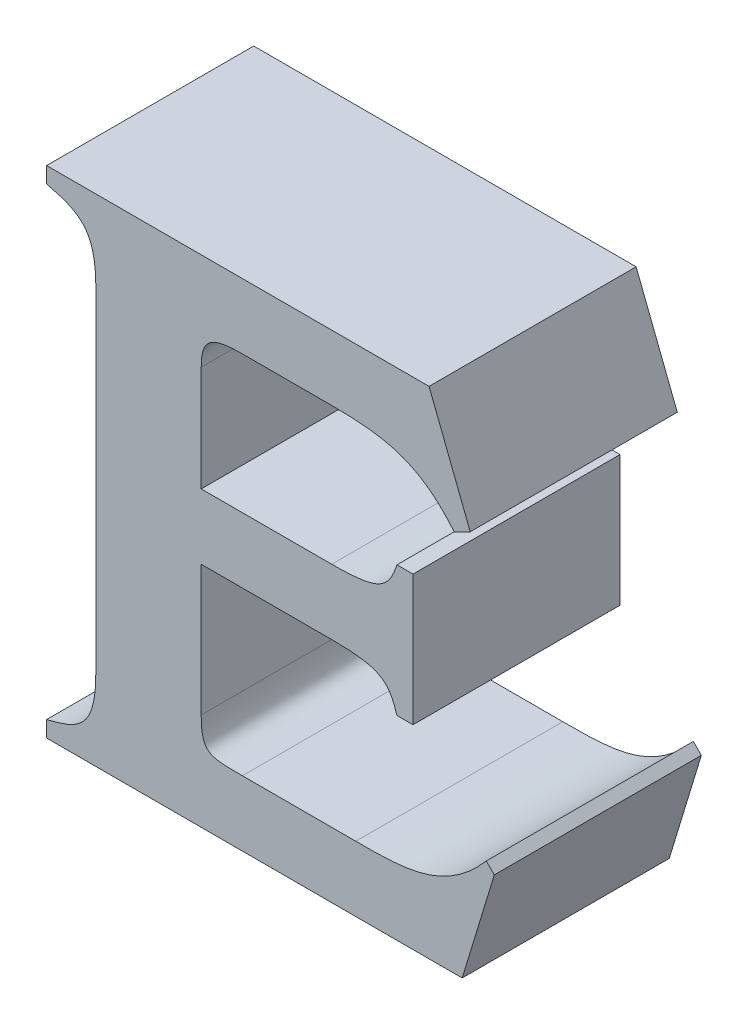
ISO-10303-21;
HEADER;
FILE_DESCRIPTION(('STEP AP214'),'2;1');
FILE_NAME('part.step','',(''),(''),'','','');
FILE_SCHEMA(('AUTOMOTIVE_DESIGN { 1 0 10303 214 1 1 1 1 }'));
ENDSEC;
DATA;
#1=APPLICATION_CONTEXT('core data for automotive mechanical design processes');
#2=APPLICATION_PROTOCOL_DEFINITION('international standard','automotive_design',2000,#1);
#3=PRODUCT_CONTEXT('',#1,'mechanical');
#4=PRODUCT('Part','Part','',(#3));
#5=PRODUCT_RELATED_PRODUCT_CATEGORY('part','',(#4));
#6=PRODUCT_DEFINITION_FORMATION('','',#4);
#7=PRODUCT_DEFINITION_CONTEXT('part definition',#1,'design');
#8=PRODUCT_DEFINITION('design','',#6,#7);
#9=PRODUCT_DEFINITION_SHAPE('','',#8);
#10=(LENGTH_UNIT() NAMED_UNIT(*) SI_UNIT(.MILLI.,.METRE.));
#11=(NAMED_UNIT(*) PLANE_ANGLE_UNIT() SI_UNIT($,.RADIAN.));
#12=(NAMED_UNIT(*) SI_UNIT($,.STERADIAN.) SOLID_ANGLE_UNIT());
#13=UNCERTAINTY_MEASURE_WITH_UNIT(LENGTH_MEASURE(1.E-05),#10,'distance_accuracy_value','');
#14=(GEOMETRIC_REPRESENTATION_CONTEXT(3) GLOBAL_UNCERTAINTY_ASSIGNED_CONTEXT((#13)) GLOBAL_UNIT_ASSIGNED_CONTEXT((#10,
#11,#12)) REPRESENTATION_CONTEXT('',''));
#15=CARTESIAN_POINT('',(0.,0.,0.));
#16=DIRECTION('',(0.,0.,1.));
#17=DIRECTION('',(1.,0.,0.));
#18=AXIS2_PLACEMENT_3D('',#15,#16,#17);
#19=CARTESIAN_POINT('',(2.3235541051335,-0.0690738994527997,0.));
#20=DIRECTION('',(0.,-1.,0.));
#21=DIRECTION('',(1.,0.,0.));
#22=AXIS2_PLACEMENT_3D('',#19,#20,#21);
#23=PLANE('',#22);
#24=DIRECTION('',(-1.,0.,0.));
#25=VECTOR('',#24,1.);
#26=CARTESIAN_POINT('',(2.5242503786031,-0.0690738994527997,0.));
#27=LINE('',#26,#25);
#28=CARTESIAN_POINT('',(2.5242503786031,-0.0690738994527997,0.));
#29=VERTEX_POINT('',#28);
#30=CARTESIAN_POINT('',(2.3235541051335,-0.0690738994527997,0.));
#31=VERTEX_POINT('',#30);
#32=EDGE_CURVE('E11',#29,#31,#27,.T.);
#33=ORIENTED_EDGE('',*,*,#32,.F.);
#34=DIRECTION('',(0.,0.,1.));
#35=VECTOR('',#34,1.);
#36=CARTESIAN_POINT('',(2.5242503786031,-0.0690738994527997,0.));
#37=LINE('',#36,#35);
#38=CARTESIAN_POINT('',(2.5242503786031,-0.0690738994527997,0.1));
#39=VERTEX_POINT('',#38);
#40=EDGE_CURVE('E24',#29,#39,#37,.T.);
#41=ORIENTED_EDGE('',*,*,#40,.T.);
#42=DIRECTION('',(1.,0.,0.));
#43=VECTOR('',#42,1.);
#44=CARTESIAN_POINT('',(2.5242503786031,-0.0690738994527997,0.1));
#45=LINE('',#44,#43);
#46=CARTESIAN_POINT('',(2.3235541051335,-0.0690738994527997,0.1));
#47=VERTEX_POINT('',#46);
#48=EDGE_CURVE('E208',#47,#39,#45,.T.);
#49=ORIENTED_EDGE('',*,*,#48,.F.);
#50=DIRECTION('',(0.,0.,1.));
#51=VECTOR('',#50,1.);
#52=CARTESIAN_POINT('',(2.3235541051335,-0.0690738994527997,0.));
#53=LINE('',#52,#51);
#54=EDGE_CURVE('E473',#31,#47,#53,.T.);
#55=ORIENTED_EDGE('',*,*,#54,.F.);
#56=EDGE_LOOP('',(#33,#41,#49,#55));
#57=FACE_BOUND('',#56,.T.);
#58=ADVANCED_FACE('F17',(#57),#23,.T.);
#59=CARTESIAN_POINT('',(2.3235541051335,-0.0613175045024918,0.));
#60=DIRECTION('',(-1.,0.,0.));
#61=DIRECTION('',(0.,-1.,0.));
#62=AXIS2_PLACEMENT_3D('',#59,#60,#61);
#63=PLANE('',#62);
#64=DIRECTION('',(0.,1.,0.));
#65=VECTOR('',#64,1.);
#66=CARTESIAN_POINT('',(2.3235541051335,-0.0690738994527997,0.));
#67=LINE('',#66,#65);
#68=CARTESIAN_POINT('',(2.3235541051335,-0.0613175045024918,0.));
#69=VERTEX_POINT('',#68);
#70=EDGE_CURVE('E471',#31,#69,#67,.T.);
#71=ORIENTED_EDGE('',*,*,#70,.F.);
#72=ORIENTED_EDGE('',*,*,#54,.T.);
#73=DIRECTION('',(0.,-1.,0.));
#74=VECTOR('',#73,1.);
#75=CARTESIAN_POINT('',(2.3235541051335,-0.0690738994527997,0.1));
#76=LINE('',#75,#74);
#77=CARTESIAN_POINT('',(2.3235541051335,-0.0613175045024918,0.1));
#78=VERTEX_POINT('',#77);
#79=EDGE_CURVE('E469',#78,#47,#76,.T.);
#80=ORIENTED_EDGE('',*,*,#79,.F.);
#81=DIRECTION('',(0.,0.,1.));
#82=VECTOR('',#81,1.);
#83=CARTESIAN_POINT('',(2.3235541051335,-0.0613175045024918,0.));
#84=LINE('',#83,#82);
#85=EDGE_CURVE('E463',#69,#78,#84,.T.);
#86=ORIENTED_EDGE('',*,*,#85,.F.);
#87=EDGE_LOOP('',(#71,#72,#80,#86));
#88=FACE_BOUND('',#87,.T.);
#89=ADVANCED_FACE('F567',(#88),#63,.T.);
#90=CARTESIAN_POINT('',(2.3473078552455,-0.0298073234104864,0.));
#91=CARTESIAN_POINT('',(2.3473078552455,-0.0298073234104864,0.1));
#92=CARTESIAN_POINT('',(2.3473078554093,-0.0535611100527961,0.));
#93=CARTESIAN_POINT('',(2.3473078554093,-0.0535611100527961,0.1));
#94=CARTESIAN_POINT('',(2.3395517125859,-0.0574392172899411,0.));
#95=CARTESIAN_POINT('',(2.3395517125859,-0.0574392172899411,0.1));
#96=CARTESIAN_POINT('',(2.3235541051335,-0.0613175045024918,0.));
#97=CARTESIAN_POINT('',(2.3235541051335,-0.0613175045024918,0.1));
#98=B_SPLINE_SURFACE_WITH_KNOTS('',3,1,((#90,#91),(#92,#93),(#94,#95),(#96,#97)),.UNSPECIFIED.,
.F.,.F.,.F.,(4,4),(2,2),(-1.,0.),(0.,0.01),.UNSPECIFIED.);
#99=CARTESIAN_POINT('',(2.3235541051335,-0.0613175045024918,0.));
#100=CARTESIAN_POINT('',(2.3395517125859,-0.0574392172899411,0.));
#101=CARTESIAN_POINT('',(2.3473078554093,-0.0535611100527961,0.));
#102=CARTESIAN_POINT('',(2.3473078552455,-0.0298073234104864,0.));
#103=B_SPLINE_CURVE_WITH_KNOTS('',3,(#99,#100,#101,#102),.UNSPECIFIED.,.F.,.F.,(4,4),(0.,1.),.UNSPECIFIED.);
#104=CARTESIAN_POINT('',(2.3473078552455,-0.0298073234104864,0.));
#105=VERTEX_POINT('',#104);
#106=EDGE_CURVE('E456',#69,#105,#103,.T.);
#107=CARTESIAN_POINT('',(2.3473078552455,-0.0298073234104864,0.1));
#108=CARTESIAN_POINT('',(2.3473078554093,-0.0535611100527961,0.1));
#109=CARTESIAN_POINT('',(2.3395517125859,-0.0574392172899411,0.1));
#110=CARTESIAN_POINT('',(2.3235541051335,-0.0613175045024918,0.1));
#111=B_SPLINE_CURVE_WITH_KNOTS('',3,(#107,#108,#109,#110),.UNSPECIFIED.,.F.,.F.,(4,4),(-1.,0.),.UNSPECIFIED.);
#112=CARTESIAN_POINT('',(2.3473078552455,-0.0298073234104864,0.1));
#113=VERTEX_POINT('',#112);
#114=EDGE_CURVE('E451',#113,#78,#111,.T.);
#115=DIRECTION('',(0.,0.,1.));
#116=VECTOR('',#115,1.);
#117=CARTESIAN_POINT('',(2.3473078552455,-0.0298073234104864,0.));
#118=LINE('',#117,#116);
#119=EDGE_CURVE('E448',#105,#113,#118,.T.);
#120=ORIENTED_EDGE('',*,*,#106,.F.);
#121=ORIENTED_EDGE('',*,*,#85,.T.);
#122=ORIENTED_EDGE('',*,*,#114,.F.);
#123=ORIENTED_EDGE('',*,*,#119,.F.);
#124=EDGE_LOOP('',(#120,#121,#122,#123));
#125=FACE_BOUND('',#124,.T.);
#126=ADVANCED_FACE('F563',(#125),#98,.T.);
#127=CARTESIAN_POINT('',(2.3473078552455,0.131137232278291,0.));
#128=DIRECTION('',(-1.,0.,0.));
#129=DIRECTION('',(0.,-1.,0.));
#130=AXIS2_PLACEMENT_3D('',#127,#128,#129);
#131=PLANE('',#130);
#132=DIRECTION('',(0.,1.,0.));
#133=VECTOR('',#132,1.);
#134=CARTESIAN_POINT('',(2.3473078552455,-0.0298073234104864,0.));
#135=LINE('',#134,#133);
#136=CARTESIAN_POINT('',(2.3473078552455,0.131137232278291,0.));
#137=VERTEX_POINT('',#136);
#138=EDGE_CURVE('E446',#105,#137,#135,.T.);
#139=ORIENTED_EDGE('',*,*,#138,.F.);
#140=ORIENTED_EDGE('',*,*,#119,.T.);
#141=DIRECTION('',(0.,-1.,0.));
#142=VECTOR('',#141,1.);
#143=CARTESIAN_POINT('',(2.3473078552455,-0.0298073234104864,0.1));
#144=LINE('',#143,#142);
#145=CARTESIAN_POINT('',(2.3473078552455,0.131137232278291,0.1));
#146=VERTEX_POINT('',#145);
#147=EDGE_CURVE('E443',#146,#113,#144,.T.);
#148=ORIENTED_EDGE('',*,*,#147,.F.);
#149=DIRECTION('',(0.,0.,1.));
#150=VECTOR('',#149,1.);
#151=CARTESIAN_POINT('',(2.3473078552455,0.131137232278291,0.));
#152=LINE('',#151,#150);
#153=EDGE_CURVE('E437',#137,#146,#152,.T.);
#154=ORIENTED_EDGE('',*,*,#153,.F.);
#155=EDGE_LOOP('',(#139,#140,#148,#154));
#156=FACE_BOUND('',#155,.T.);
#157=ADVANCED_FACE('F559',(#156),#131,.T.);
#158=CARTESIAN_POINT('',(2.3235541051335,0.162647413370297,0.));
#159=CARTESIAN_POINT('',(2.3235541051335,0.162647413370297,0.1));
#160=CARTESIAN_POINT('',(2.3395517119214,0.158769305806346,0.));
#161=CARTESIAN_POINT('',(2.3395517119214,0.158769305806346,0.1));
#162=CARTESIAN_POINT('',(2.3473078547454,0.154891054450699,0.));
#163=CARTESIAN_POINT('',(2.3473078547454,0.154891054450699,0.1));
#164=CARTESIAN_POINT('',(2.3473078552455,0.131137232278291,0.));
#165=CARTESIAN_POINT('',(2.3473078552455,0.131137232278291,0.1));
#166=B_SPLINE_SURFACE_WITH_KNOTS('',3,1,((#158,#159),(#160,#161),(#162,#163),(#164,#165)),
.UNSPECIFIED.,.F.,.F.,.F.,(4,4),(2,2),(-1.,0.),(0.,0.01),.UNSPECIFIED.);
#167=CARTESIAN_POINT('',(2.3473078552455,0.131137232278291,0.));
#168=CARTESIAN_POINT('',(2.3473078547454,0.154891054450699,0.));
#169=CARTESIAN_POINT('',(2.3395517119214,0.158769305806346,0.));
#170=CARTESIAN_POINT('',(2.3235541051335,0.162647413370297,0.));
#171=B_SPLINE_CURVE_WITH_KNOTS('',3,(#167,#168,#169,#170),.UNSPECIFIED.,.F.,.F.,(4,4),(0.,1.),.UNSPECIFIED.);
#172=CARTESIAN_POINT('',(2.3235541051335,0.162647413370297,0.));
#173=VERTEX_POINT('',#172);
#174=EDGE_CURVE('E430',#137,#173,#171,.T.);
#175=CARTESIAN_POINT('',(2.3235541051335,0.162647413370297,0.1));
#176=CARTESIAN_POINT('',(2.3395517119214,0.158769305806346,0.1));
#177=CARTESIAN_POINT('',(2.3473078547454,0.154891054450699,0.1));
#178=CARTESIAN_POINT('',(2.3473078552455,0.131137232278291,0.1));
#179=B_SPLINE_CURVE_WITH_KNOTS('',3,(#175,#176,#177,#178),.UNSPECIFIED.,.F.,.F.,(4,4),(-1.,0.),.UNSPECIFIED.);
#180=CARTESIAN_POINT('',(2.3235541051335,0.162647413370297,0.1));
#181=VERTEX_POINT('',#180);
#182=EDGE_CURVE('E425',#181,#146,#179,.T.);
#183=DIRECTION('',(0.,0.,1.));
#184=VECTOR('',#183,1.);
#185=CARTESIAN_POINT('',(2.3235541051335,0.162647413370297,0.));
#186=LINE('',#185,#184);
#187=EDGE_CURVE('E422',#173,#181,#186,.T.);
#188=ORIENTED_EDGE('',*,*,#174,.F.);
#189=ORIENTED_EDGE('',*,*,#153,.T.);
#190=ORIENTED_EDGE('',*,*,#182,.F.);
#191=ORIENTED_EDGE('',*,*,#187,.F.);
#192=EDGE_LOOP('',(#188,#189,#190,#191));
#193=FACE_BOUND('',#192,.T.);
#194=ADVANCED_FACE('F555',(#193),#166,.T.);
#195=CARTESIAN_POINT('',(2.3235541051335,0.170403808321217,0.));
#196=DIRECTION('',(-1.,0.,0.));
#197=DIRECTION('',(0.,-1.,0.));
#198=AXIS2_PLACEMENT_3D('',#195,#196,#197);
#199=PLANE('',#198);
#200=DIRECTION('',(0.,1.,0.));
#201=VECTOR('',#200,1.);
#202=CARTESIAN_POINT('',(2.3235541051335,0.162647413370297,0.));
#203=LINE('',#202,#201);
#204=CARTESIAN_POINT('',(2.3235541051335,0.170403808321217,0.));
#205=VERTEX_POINT('',#204);
#206=EDGE_CURVE('E420',#173,#205,#203,.T.);
#207=ORIENTED_EDGE('',*,*,#206,.F.);
#208=ORIENTED_EDGE('',*,*,#187,.T.);
#209=DIRECTION('',(0.,-1.,0.));
#210=VECTOR('',#209,1.);
#211=CARTESIAN_POINT('',(2.3235541051335,0.162647413370297,0.1));
#212=LINE('',#211,#210);
#213=CARTESIAN_POINT('',(2.3235541051335,0.170403808321217,0.1));
#214=VERTEX_POINT('',#213);
#215=EDGE_CURVE('E417',#214,#181,#212,.T.);
#216=ORIENTED_EDGE('',*,*,#215,.F.);
#217=DIRECTION('',(0.,0.,1.));
#218=VECTOR('',#217,1.);
#219=CARTESIAN_POINT('',(2.3235541051335,0.170403808321217,0.));
#220=LINE('',#219,#218);
#221=EDGE_CURVE('E414',#205,#214,#220,.T.);
#222=ORIENTED_EDGE('',*,*,#221,.F.);
#223=EDGE_LOOP('',(#207,#208,#216,#222));
#224=FACE_BOUND('',#223,.T.);
#225=ADVANCED_FACE('F551',(#224),#199,.T.);
#226=CARTESIAN_POINT('',(2.508252410934,0.170403808321217,0.));
#227=DIRECTION('',(0.,1.,0.));
#228=DIRECTION('',(-1.,0.,0.));
#229=AXIS2_PLACEMENT_3D('',#226,#227,#228);
#230=PLANE('',#229);
#231=DIRECTION('',(1.,0.,0.));
#232=VECTOR('',#231,1.);
#233=CARTESIAN_POINT('',(2.3235541051335,0.170403808321217,0.));
#234=LINE('',#233,#232);
#235=CARTESIAN_POINT('',(2.508252410934,0.170403808321217,0.));
#236=VERTEX_POINT('',#235);
#237=EDGE_CURVE('E412',#205,#236,#234,.T.);
#238=ORIENTED_EDGE('',*,*,#237,.F.);
#239=ORIENTED_EDGE('',*,*,#221,.T.);
#240=DIRECTION('',(-1.,0.,0.));
#241=VECTOR('',#240,1.);
#242=CARTESIAN_POINT('',(2.3235541051335,0.170403808321217,0.1));
#243=LINE('',#242,#241);
#244=CARTESIAN_POINT('',(2.508252410934,0.170403808321217,0.1));
#245=VERTEX_POINT('',#244);
#246=EDGE_CURVE('E409',#245,#214,#243,.T.);
#247=ORIENTED_EDGE('',*,*,#246,.F.);
#248=DIRECTION('',(0.,0.,1.));
#249=VECTOR('',#248,1.);
#250=CARTESIAN_POINT('',(2.508252410934,0.170403808321217,0.));
#251=LINE('',#250,#249);
#252=EDGE_CURVE('E406',#236,#245,#251,.T.);
#253=ORIENTED_EDGE('',*,*,#252,.F.);
#254=EDGE_LOOP('',(#238,#239,#247,#253));
#255=FACE_BOUND('',#254,.T.);
#256=ADVANCED_FACE('F547',(#255),#230,.T.);
#257=CARTESIAN_POINT('',(2.5281275492281,0.119502729928051,0.));
#258=DIRECTION('',(0.931507550185629,0.363721987164877,0.));
#259=DIRECTION('',(-0.363721987164877,0.931507550185629,0.));
#260=AXIS2_PLACEMENT_3D('',#257,#258,#259);
#261=PLANE('',#260);
#262=DIRECTION('',(0.363721987164877,-0.931507550185629,0.));
#263=VECTOR('',#262,1.);
#264=CARTESIAN_POINT('',(2.508252410934,0.170403808321217,0.));
#265=LINE('',#264,#263);
#266=CARTESIAN_POINT('',(2.5281275492281,0.119502729928051,0.));
#267=VERTEX_POINT('',#266);
#268=EDGE_CURVE('E404',#236,#267,#265,.T.);
#269=ORIENTED_EDGE('',*,*,#268,.F.);
#270=ORIENTED_EDGE('',*,*,#252,.T.);
#271=DIRECTION('',(-0.363721987164877,0.931507550185629,0.));
#272=VECTOR('',#271,1.);
#273=CARTESIAN_POINT('',(2.508252410934,0.170403808321217,0.1));
#274=LINE('',#273,#272);
#275=CARTESIAN_POINT('',(2.5281275492281,0.119502729928051,0.1));
#276=VERTEX_POINT('',#275);
#277=EDGE_CURVE('E401',#276,#245,#274,.T.);
#278=ORIENTED_EDGE('',*,*,#277,.F.);
#279=DIRECTION('',(0.,0.,1.));
#280=VECTOR('',#279,1.);
#281=CARTESIAN_POINT('',(2.5281275492281,0.119502729928051,0.));
#282=LINE('',#281,#280);
#283=EDGE_CURVE('E398',#267,#276,#282,.T.);
#284=ORIENTED_EDGE('',*,*,#283,.F.);
#285=EDGE_LOOP('',(#269,#270,#278,#284));
#286=FACE_BOUND('',#285,.T.);
#287=ADVANCED_FACE('F543',(#286),#261,.T.);
#288=CARTESIAN_POINT('',(2.5203714064865,0.115624478407832,0.));
#289=DIRECTION('',(0.447230214922714,-0.894418881095532,0.));
#290=DIRECTION('',(0.894418881095532,0.447230214922714,0.));
#291=AXIS2_PLACEMENT_3D('',#288,#289,#290);
#292=PLANE('',#291);
#293=DIRECTION('',(-0.894418881095532,-0.447230214922714,0.));
#294=VECTOR('',#293,1.);
#295=CARTESIAN_POINT('',(2.5281275492281,0.119502729928051,0.));
#296=LINE('',#295,#294);
#297=CARTESIAN_POINT('',(2.5203714064865,0.115624478407832,0.));
#298=VERTEX_POINT('',#297);
#299=EDGE_CURVE('E396',#267,#298,#296,.T.);
#300=ORIENTED_EDGE('',*,*,#299,.F.);
#301=ORIENTED_EDGE('',*,*,#283,.T.);
#302=DIRECTION('',(0.894418881095532,0.447230214922714,0.));
#303=VECTOR('',#302,1.);
#304=CARTESIAN_POINT('',(2.5281275492281,0.119502729928051,0.1));
#305=LINE('',#304,#303);
#306=CARTESIAN_POINT('',(2.5203714064865,0.115624478407832,0.1));
#307=VERTEX_POINT('',#306);
#308=EDGE_CURVE('E393',#307,#276,#305,.T.);
#309=ORIENTED_EDGE('',*,*,#308,.F.);
#310=DIRECTION('',(0.,0.,1.));
#311=VECTOR('',#310,1.);
#312=CARTESIAN_POINT('',(2.5203714064865,0.115624478407832,0.));
#313=LINE('',#312,#311);
#314=EDGE_CURVE('E387',#298,#307,#313,.T.);
#315=ORIENTED_EDGE('',*,*,#314,.F.);
#316=EDGE_LOOP('',(#300,#301,#309,#315));
#317=FACE_BOUND('',#316,.T.);
#318=ADVANCED_FACE('F539',(#317),#292,.T.);
#319=CARTESIAN_POINT('',(2.4612298722994,0.138893627229212,0.));
#320=CARTESIAN_POINT('',(2.4612298722994,0.138893627229212,0.1));
#321=CARTESIAN_POINT('',(2.4888611526411,0.138893626290112,0.));
#322=CARTESIAN_POINT('',(2.4888611526411,0.138893626290112,0.1));
#323=CARTESIAN_POINT('',(2.5043737985382,0.13501537523216,0.));
#324=CARTESIAN_POINT('',(2.5043737985382,0.13501537523216,0.1));
#325=CARTESIAN_POINT('',(2.5203714064865,0.115624478407832,0.));
#326=CARTESIAN_POINT('',(2.5203714064865,0.115624478407832,0.1));
#327=B_SPLINE_SURFACE_WITH_KNOTS('',3,1,((#319,#320),(#321,#322),(#323,#324),(#325,#326)),
.UNSPECIFIED.,.F.,.F.,.F.,(4,4),(2,2),(-1.,0.),(0.,0.01),.UNSPECIFIED.);
#328=CARTESIAN_POINT('',(2.5203714064865,0.115624478407832,0.));
#329=CARTESIAN_POINT('',(2.5043737985382,0.13501537523216,0.));
#330=CARTESIAN_POINT('',(2.4888611526411,0.138893626290112,0.));
#331=CARTESIAN_POINT('',(2.4612298722994,0.138893627229212,0.));
#332=B_SPLINE_CURVE_WITH_KNOTS('',3,(#328,#329,#330,#331),.UNSPECIFIED.,.F.,.F.,(4,4),(0.,1.),.UNSPECIFIED.);
#333=CARTESIAN_POINT('',(2.4612298722994,0.138893627229212,0.));
#334=VERTEX_POINT('',#333);
#335=EDGE_CURVE('E380',#298,#334,#332,.T.);
#336=CARTESIAN_POINT('',(2.4612298722994,0.138893627229212,0.1));
#337=CARTESIAN_POINT('',(2.4888611526411,0.138893626290112,0.1));
#338=CARTESIAN_POINT('',(2.5043737985382,0.13501537523216,0.1));
#339=CARTESIAN_POINT('',(2.5203714064865,0.115624478407832,0.1));
#340=B_SPLINE_CURVE_WITH_KNOTS('',3,(#336,#337,#338,#339),.UNSPECIFIED.,.F.,.F.,(4,4),(-1.,0.),.UNSPECIFIED.);
#341=CARTESIAN_POINT('',(2.4612298722994,0.138893627229212,0.1));
#342=VERTEX_POINT('',#341);
#343=EDGE_CURVE('E375',#342,#307,#340,.T.);
#344=DIRECTION('',(0.,0.,1.));
#345=VECTOR('',#344,1.);
#346=CARTESIAN_POINT('',(2.4612298722994,0.138893627229212,0.));
#347=LINE('',#346,#345);
#348=EDGE_CURVE('E372',#334,#342,#347,.T.);
#349=ORIENTED_EDGE('',*,*,#335,.F.);
#350=ORIENTED_EDGE('',*,*,#314,.T.);
#351=ORIENTED_EDGE('',*,*,#343,.F.);
#352=ORIENTED_EDGE('',*,*,#348,.F.);
#353=EDGE_LOOP('',(#349,#350,#351,#352));
#354=FACE_BOUND('',#353,.T.);
#355=ADVANCED_FACE('F535',(#354),#327,.T.);
#356=CARTESIAN_POINT('',(2.4180845042898,0.138893627229212,0.));
#357=DIRECTION('',(0.,-1.,0.));
#358=DIRECTION('',(1.,0.,0.));
#359=AXIS2_PLACEMENT_3D('',#356,#357,#358);
#360=PLANE('',#359);
#361=DIRECTION('',(-1.,0.,0.));
#362=VECTOR('',#361,1.);
#363=CARTESIAN_POINT('',(2.4612298722994,0.138893627229212,0.));
#364=LINE('',#363,#362);
#365=CARTESIAN_POINT('',(2.4180845042898,0.138893627229212,0.));
#366=VERTEX_POINT('',#365);
#367=EDGE_CURVE('E370',#334,#366,#364,.T.);
#368=ORIENTED_EDGE('',*,*,#367,.F.);
#369=ORIENTED_EDGE('',*,*,#348,.T.);
#370=DIRECTION('',(1.,0.,0.));
#371=VECTOR('',#370,1.);
#372=CARTESIAN_POINT('',(2.4612298722994,0.138893627229212,0.1));
#373=LINE('',#372,#371);
#374=CARTESIAN_POINT('',(2.4180845042898,0.138893627229212,0.1));
#375=VERTEX_POINT('',#374);
#376=EDGE_CURVE('E367',#375,#342,#373,.T.);
#377=ORIENTED_EDGE('',*,*,#376,.F.);
#378=DIRECTION('',(0.,0.,1.));
#379=VECTOR('',#378,1.);
#380=CARTESIAN_POINT('',(2.4180845042898,0.138893627229212,0.));
#381=LINE('',#380,#379);
#382=EDGE_CURVE('E361',#366,#375,#381,.T.);
#383=ORIENTED_EDGE('',*,*,#382,.F.);
#384=EDGE_LOOP('',(#368,#369,#377,#383));
#385=FACE_BOUND('',#384,.T.);
#386=ADVANCED_FACE('F531',(#385),#360,.T.);
#387=CARTESIAN_POINT('',(2.3982093659968,0.123380837328527,0.));
#388=CARTESIAN_POINT('',(2.3982093659968,0.123380837328527,0.1));
#389=CARTESIAN_POINT('',(2.3982093659967,0.135015375709031,0.));
#390=CARTESIAN_POINT('',(2.3982093659967,0.135015375709031,0.1));
#391=CARTESIAN_POINT('',(2.4020868969197,0.138893627229345,0.));
#392=CARTESIAN_POINT('',(2.4020868969197,0.138893627229345,0.1));
#393=CARTESIAN_POINT('',(2.4180845042898,0.138893627229212,0.));
#394=CARTESIAN_POINT('',(2.4180845042898,0.138893627229212,0.1));
#395=B_SPLINE_SURFACE_WITH_KNOTS('',3,1,((#387,#388),(#389,#390),(#391,#392),(#393,#394)),
.UNSPECIFIED.,.F.,.F.,.F.,(4,4),(2,2),(-1.,0.),(0.,0.01),.UNSPECIFIED.);
#396=CARTESIAN_POINT('',(2.4180845042898,0.138893627229212,0.));
#397=CARTESIAN_POINT('',(2.4020868969197,0.138893627229345,0.));
#398=CARTESIAN_POINT('',(2.3982093659967,0.135015375709031,0.));
#399=CARTESIAN_POINT('',(2.3982093659968,0.123380837328527,0.));
#400=B_SPLINE_CURVE_WITH_KNOTS('',3,(#396,#397,#398,#399),.UNSPECIFIED.,.F.,.F.,(4,4),(0.,1.),.UNSPECIFIED.);
#401=CARTESIAN_POINT('',(2.3982093659968,0.123380837328527,0.));
#402=VERTEX_POINT('',#401);
#403=EDGE_CURVE('E354',#366,#402,#400,.T.);
#404=CARTESIAN_POINT('',(2.3982093659968,0.123380837328527,0.1));
#405=CARTESIAN_POINT('',(2.3982093659967,0.135015375709031,0.1));
#406=CARTESIAN_POINT('',(2.4020868969197,0.138893627229345,0.1));
#407=CARTESIAN_POINT('',(2.4180845042898,0.138893627229212,0.1));
#408=B_SPLINE_CURVE_WITH_KNOTS('',3,(#404,#405,#406,#407),.UNSPECIFIED.,.F.,.F.,(4,4),(-1.,0.),.UNSPECIFIED.);
#409=CARTESIAN_POINT('',(2.3982093659968,0.123380837328527,0.1));
#410=VERTEX_POINT('',#409);
#411=EDGE_CURVE('E349',#410,#375,#408,.T.);
#412=DIRECTION('',(0.,0.,1.));
#413=VECTOR('',#412,1.);
#414=CARTESIAN_POINT('',(2.3982093659968,0.123380837328527,0.));
#415=LINE('',#414,#413);
#416=EDGE_CURVE('E346',#402,#410,#415,.T.);
#417=ORIENTED_EDGE('',*,*,#403,.F.);
#418=ORIENTED_EDGE('',*,*,#382,.T.);
#419=ORIENTED_EDGE('',*,*,#411,.F.);
#420=ORIENTED_EDGE('',*,*,#416,.F.);
#421=EDGE_LOOP('',(#417,#418,#419,#420));
#422=FACE_BOUND('',#421,.T.);
#423=ADVANCED_FACE('F527',(#422),#395,.T.);
#424=CARTESIAN_POINT('',(2.3982093659968,0.0724797589353617,0.));
#425=DIRECTION('',(1.,0.,0.));
#426=DIRECTION('',(0.,1.,0.));
#427=AXIS2_PLACEMENT_3D('',#424,#425,#426);
#428=PLANE('',#427);
#429=DIRECTION('',(0.,-1.,0.));
#430=VECTOR('',#429,1.);
#431=CARTESIAN_POINT('',(2.3982093659968,0.123380837328527,0.));
#432=LINE('',#431,#430);
#433=CARTESIAN_POINT('',(2.3982093659968,0.0724797589353617,0.));
#434=VERTEX_POINT('',#433);
#435=EDGE_CURVE('E344',#402,#434,#432,.T.);
#436=ORIENTED_EDGE('',*,*,#435,.F.);
#437=ORIENTED_EDGE('',*,*,#416,.T.);
#438=DIRECTION('',(0.,1.,0.));
#439=VECTOR('',#438,1.);
#440=CARTESIAN_POINT('',(2.3982093659968,0.123380837328527,0.1));
#441=LINE('',#440,#439);
#442=CARTESIAN_POINT('',(2.3982093659968,0.0724797589353617,0.1));
#443=VERTEX_POINT('',#442);
#444=EDGE_CURVE('E341',#443,#410,#441,.T.);
#445=ORIENTED_EDGE('',*,*,#444,.F.);
#446=DIRECTION('',(0.,0.,1.));
#447=VECTOR('',#446,1.);
#448=CARTESIAN_POINT('',(2.3982093659968,0.0724797589353617,0.));
#449=LINE('',#448,#447);
#450=EDGE_CURVE('E338',#434,#443,#449,.T.);
#451=ORIENTED_EDGE('',*,*,#450,.F.);
#452=EDGE_LOOP('',(#436,#437,#445,#451));
#453=FACE_BOUND('',#452,.T.);
#454=ADVANCED_FACE('F523',(#453),#428,.T.);
#455=CARTESIAN_POINT('',(2.4612298722994,0.0724797589353617,0.));
#456=DIRECTION('',(0.,1.,0.));
#457=DIRECTION('',(-1.,0.,0.));
#458=AXIS2_PLACEMENT_3D('',#455,#456,#457);
#459=PLANE('',#458);
#460=DIRECTION('',(1.,0.,0.));
#461=VECTOR('',#460,1.);
#462=CARTESIAN_POINT('',(2.3982093659968,0.0724797589353617,0.));
#463=LINE('',#462,#461);
#464=CARTESIAN_POINT('',(2.4612298722994,0.0724797589353617,0.));
#465=VERTEX_POINT('',#464);
#466=EDGE_CURVE('E336',#434,#465,#463,.T.);
#467=ORIENTED_EDGE('',*,*,#466,.F.);
#468=ORIENTED_EDGE('',*,*,#450,.T.);
#469=DIRECTION('',(-1.,0.,0.));
#470=VECTOR('',#469,1.);
#471=CARTESIAN_POINT('',(2.3982093659968,0.0724797589353617,0.1));
#472=LINE('',#471,#470);
#473=CARTESIAN_POINT('',(2.4612298722994,0.0724797589353617,0.1));
#474=VERTEX_POINT('',#473);
#475=EDGE_CURVE('E333',#474,#443,#472,.T.);
#476=ORIENTED_EDGE('',*,*,#475,.F.);
#477=DIRECTION('',(0.,0.,1.));
#478=VECTOR('',#477,1.);
#479=CARTESIAN_POINT('',(2.4612298722994,0.0724797589353617,0.));
#480=LINE('',#479,#478);
#481=EDGE_CURVE('E327',#465,#474,#480,.T.);
#482=ORIENTED_EDGE('',*,*,#481,.F.);
#483=EDGE_LOOP('',(#467,#468,#476,#482));
#484=FACE_BOUND('',#483,.T.);
#485=ADVANCED_FACE('F519',(#484),#459,.T.);
#486=CARTESIAN_POINT('',(2.4927401254518,0.0879925488360465,0.));
#487=CARTESIAN_POINT('',(2.4927401254518,0.0879925488360465,0.1));
#488=CARTESIAN_POINT('',(2.488861153277,0.076357902777654,0.));
#489=CARTESIAN_POINT('',(2.488861153277,0.076357902777654,0.1));
#490=CARTESIAN_POINT('',(2.4849839827101,0.0724797592893302,0.));
#491=CARTESIAN_POINT('',(2.4849839827101,0.0724797592893302,0.1));
#492=CARTESIAN_POINT('',(2.4612298722994,0.0724797589353617,0.));
#493=CARTESIAN_POINT('',(2.4612298722994,0.0724797589353617,0.1));
#494=B_SPLINE_SURFACE_WITH_KNOTS('',3,1,((#486,#487),(#488,#489),(#490,#491),(#492,#493)),
.UNSPECIFIED.,.F.,.F.,.F.,(4,4),(2,2),(-1.,0.),(0.,0.01),.UNSPECIFIED.);
#495=CARTESIAN_POINT('',(2.4612298722994,0.0724797589353617,0.));
#496=CARTESIAN_POINT('',(2.4849839827101,0.0724797592893302,0.));
#497=CARTESIAN_POINT('',(2.488861153277,0.076357902777654,0.));
#498=CARTESIAN_POINT('',(2.4927401254518,0.0879925488360465,0.));
#499=B_SPLINE_CURVE_WITH_KNOTS('',3,(#495,#496,#497,#498),.UNSPECIFIED.,.F.,.F.,(4,4),(0.,1.),.UNSPECIFIED.);
#500=CARTESIAN_POINT('',(2.4927401254518,0.0879925488360465,0.));
#501=VERTEX_POINT('',#500);
#502=EDGE_CURVE('E320',#465,#501,#499,.T.);
#503=CARTESIAN_POINT('',(2.4927401254518,0.0879925488360465,0.1));
#504=CARTESIAN_POINT('',(2.488861153277,0.076357902777654,0.1));
#505=CARTESIAN_POINT('',(2.4849839827101,0.0724797592893302,0.1));
#506=CARTESIAN_POINT('',(2.4612298722994,0.0724797589353617,0.1));
#507=B_SPLINE_CURVE_WITH_KNOTS('',3,(#503,#504,#505,#506),.UNSPECIFIED.,.F.,.F.,(4,4),(-1.,0.),.UNSPECIFIED.);
#508=CARTESIAN_POINT('',(2.4927401254518,0.0879925488360465,0.1));
#509=VERTEX_POINT('',#508);
#510=EDGE_CURVE('E315',#509,#474,#507,.T.);
#511=DIRECTION('',(0.,0.,1.));
#512=VECTOR('',#511,1.);
#513=CARTESIAN_POINT('',(2.4927401254518,0.0879925488360465,0.));
#514=LINE('',#513,#512);
#515=EDGE_CURVE('E312',#501,#509,#514,.T.);
#516=ORIENTED_EDGE('',*,*,#502,.F.);
#517=ORIENTED_EDGE('',*,*,#481,.T.);
#518=ORIENTED_EDGE('',*,*,#510,.F.);
#519=ORIENTED_EDGE('',*,*,#515,.F.);
#520=EDGE_LOOP('',(#516,#517,#518,#519));
#521=FACE_BOUND('',#520,.T.);
#522=ADVANCED_FACE('F515',(#521),#494,.T.);
#523=CARTESIAN_POINT('',(2.5004962681935,0.0879925488360465,0.));
#524=DIRECTION('',(0.,1.,0.));
#525=DIRECTION('',(-1.,0.,0.));
#526=AXIS2_PLACEMENT_3D('',#523,#524,#525);
#527=PLANE('',#526);
#528=DIRECTION('',(1.,0.,0.));
#529=VECTOR('',#528,1.);
#530=CARTESIAN_POINT('',(2.4927401254518,0.0879925488360465,0.));
#531=LINE('',#530,#529);
#532=CARTESIAN_POINT('',(2.5004962681935,0.0879925488360465,0.));
#533=VERTEX_POINT('',#532);
#534=EDGE_CURVE('E310',#501,#533,#531,.T.);
#535=ORIENTED_EDGE('',*,*,#534,.F.);
#536=ORIENTED_EDGE('',*,*,#515,.T.);
#537=DIRECTION('',(-1.,0.,0.));
#538=VECTOR('',#537,1.);
#539=CARTESIAN_POINT('',(2.4927401254518,0.0879925488360465,0.1));
#540=LINE('',#539,#538);
#541=CARTESIAN_POINT('',(2.5004962681935,0.0879925488360465,0.1));
#542=VERTEX_POINT('',#541);
#543=EDGE_CURVE('E307',#542,#509,#540,.T.);
#544=ORIENTED_EDGE('',*,*,#543,.F.);
#545=DIRECTION('',(0.,0.,1.));
#546=VECTOR('',#545,1.);
#547=CARTESIAN_POINT('',(2.5004962681935,0.0879925488360465,0.));
#548=LINE('',#547,#546);
#549=EDGE_CURVE('E304',#533,#542,#548,.T.);
#550=ORIENTED_EDGE('',*,*,#549,.F.);
#551=EDGE_LOOP('',(#535,#536,#544,#550));
#552=FACE_BOUND('',#551,.T.);
#553=ADVANCED_FACE('F511',(#552),#527,.T.);
#554=CARTESIAN_POINT('',(2.5004962681935,0.0249720425322917,0.));
#555=DIRECTION('',(1.,0.,0.));
#556=DIRECTION('',(0.,1.,0.));
#557=AXIS2_PLACEMENT_3D('',#554,#555,#556);
#558=PLANE('',#557);
#559=DIRECTION('',(0.,-1.,0.));
#560=VECTOR('',#559,1.);
#561=CARTESIAN_POINT('',(2.5004962681935,0.0879925488360465,0.));
#562=LINE('',#561,#560);
#563=CARTESIAN_POINT('',(2.5004962681935,0.0249720425322917,0.));
#564=VERTEX_POINT('',#563);
#565=EDGE_CURVE('E302',#533,#564,#562,.T.);
#566=ORIENTED_EDGE('',*,*,#565,.F.);
#567=ORIENTED_EDGE('',*,*,#549,.T.);
#568=DIRECTION('',(0.,1.,0.));
#569=VECTOR('',#568,1.);
#570=CARTESIAN_POINT('',(2.5004962681935,0.0879925488360465,0.1));
#571=LINE('',#570,#569);
#572=CARTESIAN_POINT('',(2.5004962681935,0.0249720425322917,0.1));
#573=VERTEX_POINT('',#572);
#574=EDGE_CURVE('E299',#573,#542,#571,.T.);
#575=ORIENTED_EDGE('',*,*,#574,.F.);
#576=DIRECTION('',(0.,0.,1.));
#577=VECTOR('',#576,1.);
#578=CARTESIAN_POINT('',(2.5004962681935,0.0249720425322917,0.));
#579=LINE('',#578,#577);
#580=EDGE_CURVE('E296',#564,#573,#579,.T.);
#581=ORIENTED_EDGE('',*,*,#580,.F.);
#582=EDGE_LOOP('',(#566,#567,#575,#581));
#583=FACE_BOUND('',#582,.T.);
#584=ADVANCED_FACE('F507',(#583),#558,.T.);
#585=CARTESIAN_POINT('',(2.4927401254518,0.0249720425322917,0.));
#586=DIRECTION('',(0.,-1.,0.));
#587=DIRECTION('',(1.,0.,0.));
#588=AXIS2_PLACEMENT_3D('',#585,#586,#587);
#589=PLANE('',#588);
#590=DIRECTION('',(-1.,0.,0.));
#591=VECTOR('',#590,1.);
#592=CARTESIAN_POINT('',(2.5004962681935,0.0249720425322917,0.));
#593=LINE('',#592,#591);
#594=CARTESIAN_POINT('',(2.4927401254518,0.0249720425322917,0.));
#595=VERTEX_POINT('',#594);
#596=EDGE_CURVE('E294',#564,#595,#593,.T.);
#597=ORIENTED_EDGE('',*,*,#596,.F.);
#598=ORIENTED_EDGE('',*,*,#580,.T.);
#599=DIRECTION('',(1.,0.,0.));
#600=VECTOR('',#599,1.);
#601=CARTESIAN_POINT('',(2.5004962681935,0.0249720425322917,0.1));
#602=LINE('',#601,#600);
#603=CARTESIAN_POINT('',(2.4927401254518,0.0249720425322917,0.1));
#604=VERTEX_POINT('',#603);
#605=EDGE_CURVE('E291',#604,#573,#602,.T.);
#606=ORIENTED_EDGE('',*,*,#605,.F.);
#607=DIRECTION('',(0.,0.,1.));
#608=VECTOR('',#607,1.);
#609=CARTESIAN_POINT('',(2.4927401254518,0.0249720425322917,0.));
#610=LINE('',#609,#608);
#611=EDGE_CURVE('E285',#595,#604,#610,.T.);
#612=ORIENTED_EDGE('',*,*,#611,.F.);
#613=EDGE_LOOP('',(#597,#598,#606,#612));
#614=FACE_BOUND('',#613,.T.);
#615=ADVANCED_FACE('F503',(#614),#589,.T.);
#616=CARTESIAN_POINT('',(2.4612298722994,0.0409695778433569,0.));
#617=CARTESIAN_POINT('',(2.4612298722994,0.0409695778433569,0.1));
#618=CARTESIAN_POINT('',(2.4849839822744,0.0409695776320734,0.));
#619=CARTESIAN_POINT('',(2.4849839822744,0.0409695776320734,0.1));
#620=CARTESIAN_POINT('',(2.4888611530045,0.0370913262175096,0.));
#621=CARTESIAN_POINT('',(2.4888611530045,0.0370913262175096,0.1));
#622=CARTESIAN_POINT('',(2.4927401254518,0.0249720425322917,0.));
#623=CARTESIAN_POINT('',(2.4927401254518,0.0249720425322917,0.1));
#624=B_SPLINE_SURFACE_WITH_KNOTS('',3,1,((#616,#617),(#618,#619),(#620,#621),(#622,#623)),
.UNSPECIFIED.,.F.,.F.,.F.,(4,4),(2,2),(-1.,0.),(0.,0.01),.UNSPECIFIED.);
#625=CARTESIAN_POINT('',(2.4927401254518,0.0249720425322917,0.));
#626=CARTESIAN_POINT('',(2.4888611530045,0.0370913262175096,0.));
#627=CARTESIAN_POINT('',(2.4849839822744,0.0409695776320734,0.));
#628=CARTESIAN_POINT('',(2.4612298722994,0.0409695778433569,0.));
#629=B_SPLINE_CURVE_WITH_KNOTS('',3,(#625,#626,#627,#628),.UNSPECIFIED.,.F.,.F.,(4,4),(0.,1.),.UNSPECIFIED.);
#630=CARTESIAN_POINT('',(2.4612298722994,0.0409695778433569,0.));
#631=VERTEX_POINT('',#630);
#632=EDGE_CURVE('E278',#595,#631,#629,.T.);
#633=CARTESIAN_POINT('',(2.4612298722994,0.0409695778433569,0.1));
#634=CARTESIAN_POINT('',(2.4849839822744,0.0409695776320734,0.1));
#635=CARTESIAN_POINT('',(2.4888611530045,0.0370913262175096,0.1));
#636=CARTESIAN_POINT('',(2.4927401254518,0.0249720425322917,0.1));
#637=B_SPLINE_CURVE_WITH_KNOTS('',3,(#633,#634,#635,#636),.UNSPECIFIED.,.F.,.F.,(4,4),(-1.,0.),.UNSPECIFIED.);
#638=CARTESIAN_POINT('',(2.4612298722994,0.0409695778433569,0.1));
#639=VERTEX_POINT('',#638);
#640=EDGE_CURVE('E273',#639,#604,#637,.T.);
#641=DIRECTION('',(0.,0.,1.));
#642=VECTOR('',#641,1.);
#643=CARTESIAN_POINT('',(2.4612298722994,0.0409695778433569,0.));
#644=LINE('',#643,#642);
#645=EDGE_CURVE('E270',#631,#639,#644,.T.);
#646=ORIENTED_EDGE('',*,*,#632,.F.);
#647=ORIENTED_EDGE('',*,*,#611,.T.);
#648=ORIENTED_EDGE('',*,*,#640,.F.);
#649=ORIENTED_EDGE('',*,*,#645,.F.);
#650=EDGE_LOOP('',(#646,#647,#648,#649));
#651=FACE_BOUND('',#650,.T.);
#652=ADVANCED_FACE('F499',(#651),#624,.T.);
#653=CARTESIAN_POINT('',(2.3982093659968,0.0409695778433569,0.));
#654=DIRECTION('',(0.,-1.,0.));
#655=DIRECTION('',(1.,0.,0.));
#656=AXIS2_PLACEMENT_3D('',#653,#654,#655);
#657=PLANE('',#656);
#658=DIRECTION('',(-1.,0.,0.));
#659=VECTOR('',#658,1.);
#660=CARTESIAN_POINT('',(2.4612298722994,0.0409695778433569,0.));
#661=LINE('',#660,#659);
#662=CARTESIAN_POINT('',(2.3982093659968,0.0409695778433569,0.));
#663=VERTEX_POINT('',#662);
#664=EDGE_CURVE('E268',#631,#663,#661,.T.);
#665=ORIENTED_EDGE('',*,*,#664,.F.);
#666=ORIENTED_EDGE('',*,*,#645,.T.);
#667=DIRECTION('',(1.,0.,0.));
#668=VECTOR('',#667,1.);
#669=CARTESIAN_POINT('',(2.4612298722994,0.0409695778433569,0.1));
#670=LINE('',#669,#668);
#671=CARTESIAN_POINT('',(2.3982093659968,0.0409695778433569,0.1));
#672=VERTEX_POINT('',#671);
#673=EDGE_CURVE('E265',#672,#639,#670,.T.);
#674=ORIENTED_EDGE('',*,*,#673,.F.);
#675=DIRECTION('',(0.,0.,1.));
#676=VECTOR('',#675,1.);
#677=CARTESIAN_POINT('',(2.3982093659968,0.0409695778433569,0.));
#678=LINE('',#677,#676);
#679=EDGE_CURVE('E262',#663,#672,#678,.T.);
#680=ORIENTED_EDGE('',*,*,#679,.F.);
#681=EDGE_LOOP('',(#665,#666,#674,#680));
#682=FACE_BOUND('',#681,.T.);
#683=ADVANCED_FACE('F495',(#682),#657,.T.);
#684=CARTESIAN_POINT('',(2.3982093659968,-0.022050928460179,0.));
#685=DIRECTION('',(1.,0.,0.));
#686=DIRECTION('',(0.,1.,0.));
#687=AXIS2_PLACEMENT_3D('',#684,#685,#686);
#688=PLANE('',#687);
#689=DIRECTION('',(0.,-1.,0.));
#690=VECTOR('',#689,1.);
#691=CARTESIAN_POINT('',(2.3982093659968,0.0409695778433569,0.));
#692=LINE('',#691,#690);
#693=CARTESIAN_POINT('',(2.3982093659968,-0.022050928460179,0.));
#694=VERTEX_POINT('',#693);
#695=EDGE_CURVE('E260',#663,#694,#692,.T.);
#696=ORIENTED_EDGE('',*,*,#695,.F.);
#697=ORIENTED_EDGE('',*,*,#679,.T.);
#698=DIRECTION('',(0.,1.,0.));
#699=VECTOR('',#698,1.);
#700=CARTESIAN_POINT('',(2.3982093659968,0.0409695778433569,0.1));
#701=LINE('',#700,#699);
#702=CARTESIAN_POINT('',(2.3982093659968,-0.022050928460179,0.1));
#703=VERTEX_POINT('',#702);
#704=EDGE_CURVE('E257',#703,#672,#701,.T.);
#705=ORIENTED_EDGE('',*,*,#704,.F.);
#706=DIRECTION('',(0.,0.,1.));
#707=VECTOR('',#706,1.);
#708=CARTESIAN_POINT('',(2.3982093659968,-0.022050928460179,0.));
#709=LINE('',#708,#707);
#710=EDGE_CURVE('E251',#694,#703,#709,.T.);
#711=ORIENTED_EDGE('',*,*,#710,.F.);
#712=EDGE_LOOP('',(#696,#697,#705,#711));
#713=FACE_BOUND('',#712,.T.);
#714=ADVANCED_FACE('F491',(#713),#688,.T.);
#715=CARTESIAN_POINT('',(2.4180845042898,-0.0375635742414309,0.));
#716=CARTESIAN_POINT('',(2.4180845042898,-0.0375635742414309,0.1));
#717=CARTESIAN_POINT('',(2.4020868971509,-0.0375635741837666,0.));
#718=CARTESIAN_POINT('',(2.4020868971509,-0.0375635741837666,0.1));
#719=CARTESIAN_POINT('',(2.398209366228,-0.0375635742415675,0.));
#720=CARTESIAN_POINT('',(2.398209366228,-0.0375635742415675,0.1));
#721=CARTESIAN_POINT('',(2.3982093659968,-0.022050928460179,0.));
#722=CARTESIAN_POINT('',(2.3982093659968,-0.022050928460179,0.1));
#723=B_SPLINE_SURFACE_WITH_KNOTS('',3,1,((#715,#716),(#717,#718),(#719,#720),(#721,#722)),
.UNSPECIFIED.,.F.,.F.,.F.,(4,4),(2,2),(-1.,0.),(0.,0.01),.UNSPECIFIED.);
#724=CARTESIAN_POINT('',(2.3982093659968,-0.022050928460179,0.));
#725=CARTESIAN_POINT('',(2.398209366228,-0.0375635742415675,0.));
#726=CARTESIAN_POINT('',(2.4020868971509,-0.0375635741837666,0.));
#727=CARTESIAN_POINT('',(2.4180845042898,-0.0375635742414309,0.));
#728=B_SPLINE_CURVE_WITH_KNOTS('',3,(#724,#725,#726,#727),.UNSPECIFIED.,.F.,.F.,(4,4),(0.,1.),.UNSPECIFIED.);
#729=CARTESIAN_POINT('',(2.4180845042898,-0.0375635742414309,0.));
#730=VERTEX_POINT('',#729);
#731=EDGE_CURVE('E244',#694,#730,#728,.T.);
#732=CARTESIAN_POINT('',(2.4180845042898,-0.0375635742414309,0.1));
#733=CARTESIAN_POINT('',(2.4020868971509,-0.0375635741837666,0.1));
#734=CARTESIAN_POINT('',(2.398209366228,-0.0375635742415675,0.1));
#735=CARTESIAN_POINT('',(2.3982093659968,-0.022050928460179,0.1));
#736=B_SPLINE_CURVE_WITH_KNOTS('',3,(#732,#733,#734,#735),.UNSPECIFIED.,.F.,.F.,(4,4),(-1.,0.),.UNSPECIFIED.);
#737=CARTESIAN_POINT('',(2.4180845042898,-0.0375635742414309,0.1));
#738=VERTEX_POINT('',#737);
#739=EDGE_CURVE('E239',#738,#703,#736,.T.);
#740=DIRECTION('',(0.,0.,1.));
#741=VECTOR('',#740,1.);
#742=CARTESIAN_POINT('',(2.4180845042898,-0.0375635742414309,0.));
#743=LINE('',#742,#741);
#744=EDGE_CURVE('E236',#730,#738,#743,.T.);
#745=ORIENTED_EDGE('',*,*,#731,.F.);
#746=ORIENTED_EDGE('',*,*,#710,.T.);
#747=ORIENTED_EDGE('',*,*,#739,.F.);
#748=ORIENTED_EDGE('',*,*,#744,.F.);
#749=EDGE_LOOP('',(#745,#746,#747,#748));
#750=FACE_BOUND('',#749,.T.);
#751=ADVANCED_FACE('F487',(#750),#723,.T.);
#752=CARTESIAN_POINT('',(2.4728635459648,-0.0375635742414309,0.));
#753=DIRECTION('',(0.,1.,0.));
#754=DIRECTION('',(-1.,0.,0.));
#755=AXIS2_PLACEMENT_3D('',#752,#753,#754);
#756=PLANE('',#755);
#757=DIRECTION('',(1.,0.,0.));
#758=VECTOR('',#757,1.);
#759=CARTESIAN_POINT('',(2.4180845042898,-0.0375635742414309,0.));
#760=LINE('',#759,#758);
#761=CARTESIAN_POINT('',(2.4728635459648,-0.0375635742414309,0.));
#762=VERTEX_POINT('',#761);
#763=EDGE_CURVE('E234',#730,#762,#760,.T.);
#764=ORIENTED_EDGE('',*,*,#763,.F.);
#765=ORIENTED_EDGE('',*,*,#744,.T.);
#766=DIRECTION('',(-1.,0.,0.));
#767=VECTOR('',#766,1.);
#768=CARTESIAN_POINT('',(2.4180845042898,-0.0375635742414309,0.1));
#769=LINE('',#768,#767);
#770=CARTESIAN_POINT('',(2.4728635459648,-0.0375635742414309,0.1));
#771=VERTEX_POINT('',#770);
#772=EDGE_CURVE('E231',#771,#738,#769,.T.);
#773=ORIENTED_EDGE('',*,*,#772,.F.);
#774=DIRECTION('',(0.,0.,1.));
#775=VECTOR('',#774,1.);
#776=CARTESIAN_POINT('',(2.4728635459648,-0.0375635742414309,0.));
#777=LINE('',#776,#775);
#778=EDGE_CURVE('E225',#762,#771,#777,.T.);
#779=ORIENTED_EDGE('',*,*,#778,.F.);
#780=EDGE_LOOP('',(#764,#765,#773,#779));
#781=FACE_BOUND('',#780,.T.);
#782=ADVANCED_FACE('F483',(#781),#756,.T.);
#783=CARTESIAN_POINT('',(2.5358840522674,-0.0142945335098711,0.));
#784=CARTESIAN_POINT('',(2.5358840522674,-0.0142945335098711,0.1));
#785=CARTESIAN_POINT('',(2.5160089139743,-0.0375635757935176,0.));
#786=CARTESIAN_POINT('',(2.5160089139743,-0.0375635757935176,0.1));
#787=CARTESIAN_POINT('',(2.4966172960771,-0.0375635750960672,0.));
#788=CARTESIAN_POINT('',(2.4966172960771,-0.0375635750960672,0.1));
#789=CARTESIAN_POINT('',(2.4728635459648,-0.0375635742414309,0.));
#790=CARTESIAN_POINT('',(2.4728635459648,-0.0375635742414309,0.1));
#791=B_SPLINE_SURFACE_WITH_KNOTS('',3,1,((#783,#784),(#785,#786),(#787,#788),(#789,#790)),
.UNSPECIFIED.,.F.,.F.,.F.,(4,4),(2,2),(-1.,0.),(0.,0.01),.UNSPECIFIED.);
#792=CARTESIAN_POINT('',(2.4728635459648,-0.0375635742414309,0.));
#793=CARTESIAN_POINT('',(2.4966172960771,-0.0375635750960672,0.));
#794=CARTESIAN_POINT('',(2.5160089139743,-0.0375635757935176,0.));
#795=CARTESIAN_POINT('',(2.5358840522674,-0.0142945335098711,0.));
#796=B_SPLINE_CURVE_WITH_KNOTS('',3,(#792,#793,#794,#795),.UNSPECIFIED.,.F.,.F.,(4,4),(0.,1.),.UNSPECIFIED.);
#797=CARTESIAN_POINT('',(2.5358840522674,-0.0142945335098711,0.));
#798=VERTEX_POINT('',#797);
#799=EDGE_CURVE('E218',#762,#798,#796,.T.);
#800=CARTESIAN_POINT('',(2.5358840522674,-0.0142945335098711,0.1));
#801=CARTESIAN_POINT('',(2.5160089139743,-0.0375635757935176,0.1));
#802=CARTESIAN_POINT('',(2.4966172960771,-0.0375635750960672,0.1));
#803=CARTESIAN_POINT('',(2.4728635459648,-0.0375635742414309,0.1));
#804=B_SPLINE_CURVE_WITH_KNOTS('',3,(#800,#801,#802,#803),.UNSPECIFIED.,.F.,.F.,(4,4),(-1.,0.),.UNSPECIFIED.);
#805=CARTESIAN_POINT('',(2.5358840522674,-0.0142945335098711,0.1));
#806=VERTEX_POINT('',#805);
#807=EDGE_CURVE('E214',#806,#771,#804,.T.);
#808=DIRECTION('',(0.,0.,1.));
#809=VECTOR('',#808,1.);
#810=CARTESIAN_POINT('',(2.5358840522674,-0.0142945335098711,0.));
#811=LINE('',#810,#809);
#812=EDGE_CURVE('E193',#798,#806,#811,.T.);
#813=ORIENTED_EDGE('',*,*,#799,.F.);
#814=ORIENTED_EDGE('',*,*,#778,.T.);
#815=ORIENTED_EDGE('',*,*,#807,.F.);
#816=ORIENTED_EDGE('',*,*,#812,.F.);
#817=EDGE_LOOP('',(#813,#814,#815,#816));
#818=FACE_BOUND('',#817,.T.);
#819=ADVANCED_FACE('F481',(#818),#791,.T.);
#820=CARTESIAN_POINT('',(2.5397626640864,-0.0181726769402712,0.));
#821=DIRECTION('',(0.707064081533421,0.70714947826135,0.));
#822=DIRECTION('',(-0.70714947826135,0.707064081533421,0.));
#823=AXIS2_PLACEMENT_3D('',#820,#821,#822);
#824=PLANE('',#823);
#825=DIRECTION('',(0.70714947826135,-0.707064081533421,0.));
#826=VECTOR('',#825,1.);
#827=CARTESIAN_POINT('',(2.5358840522674,-0.0142945335098711,0.));
#828=LINE('',#827,#826);
#829=CARTESIAN_POINT('',(2.5397626640864,-0.0181726769402712,0.));
#830=VERTEX_POINT('',#829);
#831=EDGE_CURVE('E197',#798,#830,#828,.T.);
#832=ORIENTED_EDGE('',*,*,#831,.F.);
#833=ORIENTED_EDGE('',*,*,#812,.T.);
#834=DIRECTION('',(-0.70714947826135,0.707064081533421,0.));
#835=VECTOR('',#834,1.);
#836=CARTESIAN_POINT('',(2.5358840522674,-0.0142945335098711,0.1));
#837=LINE('',#836,#835);
#838=CARTESIAN_POINT('',(2.5397626640864,-0.0181726769402712,0.1));
#839=VERTEX_POINT('',#838);
#840=EDGE_CURVE('E186',#839,#806,#837,.T.);
#841=ORIENTED_EDGE('',*,*,#840,.F.);
#842=DIRECTION('',(0.,0.,1.));
#843=VECTOR('',#842,1.);
#844=CARTESIAN_POINT('',(2.5397626640864,-0.0181726769402712,0.));
#845=LINE('',#844,#843);
#846=EDGE_CURVE('E190',#830,#839,#845,.T.);
#847=ORIENTED_EDGE('',*,*,#846,.F.);
#848=EDGE_LOOP('',(#832,#833,#841,#847));
#849=FACE_BOUND('',#848,.T.);
#850=ADVANCED_FACE('F189',(#849),#824,.T.);
#851=CARTESIAN_POINT('',(2.5242503786031,-0.0690738994527997,0.));
#852=DIRECTION('',(0.956565934235328,-0.291516060381748,0.));
#853=DIRECTION('',(0.291516060381748,0.956565934235328,0.));
#854=AXIS2_PLACEMENT_3D('',#851,#852,#853);
#855=PLANE('',#854);
#856=DIRECTION('',(-0.291516060381748,-0.956565934235328,0.));
#857=VECTOR('',#856,1.);
#858=CARTESIAN_POINT('',(2.5397626640864,-0.0181726769402712,0.));
#859=LINE('',#858,#857);
#860=EDGE_CURVE('E203',#830,#29,#859,.T.);
#861=ORIENTED_EDGE('',*,*,#860,.F.);
#862=ORIENTED_EDGE('',*,*,#846,.T.);
#863=DIRECTION('',(0.291516060381748,0.956565934235328,0.));
#864=VECTOR('',#863,1.);
#865=CARTESIAN_POINT('',(2.5397626640864,-0.0181726769402712,0.1));
#866=LINE('',#865,#864);
#867=EDGE_CURVE('E202',#39,#839,#866,.T.);
#868=ORIENTED_EDGE('',*,*,#867,.F.);
#869=ORIENTED_EDGE('',*,*,#40,.F.);
#870=EDGE_LOOP('',(#861,#862,#868,#869));
#871=FACE_BOUND('',#870,.T.);
#872=ADVANCED_FACE('F201',(#871),#855,.T.);
#873=CARTESIAN_POINT('',(2.4291563658493,0.0495365643271491,0.));
#874=DIRECTION('',(0.,0.,1.));
#875=DIRECTION('',(1.,0.,0.));
#876=AXIS2_PLACEMENT_3D('',#873,#874,#875);
#877=PLANE('',#876);
#878=ORIENTED_EDGE('',*,*,#860,.T.);
#879=ORIENTED_EDGE('',*,*,#32,.T.);
#880=ORIENTED_EDGE('',*,*,#70,.T.);
#881=ORIENTED_EDGE('',*,*,#106,.T.);
#882=ORIENTED_EDGE('',*,*,#138,.T.);
#883=ORIENTED_EDGE('',*,*,#174,.T.);
#884=ORIENTED_EDGE('',*,*,#206,.T.);
#885=ORIENTED_EDGE('',*,*,#237,.T.);
#886=ORIENTED_EDGE('',*,*,#268,.T.);
#887=ORIENTED_EDGE('',*,*,#299,.T.);
#888=ORIENTED_EDGE('',*,*,#335,.T.);
#889=ORIENTED_EDGE('',*,*,#367,.T.);
#890=ORIENTED_EDGE('',*,*,#403,.T.);
#891=ORIENTED_EDGE('',*,*,#435,.T.);
#892=ORIENTED_EDGE('',*,*,#466,.T.);
#893=ORIENTED_EDGE('',*,*,#502,.T.);
#894=ORIENTED_EDGE('',*,*,#534,.T.);
#895=ORIENTED_EDGE('',*,*,#565,.T.);
#896=ORIENTED_EDGE('',*,*,#596,.T.);
#897=ORIENTED_EDGE('',*,*,#632,.T.);
#898=ORIENTED_EDGE('',*,*,#664,.T.);
#899=ORIENTED_EDGE('',*,*,#695,.T.);
#900=ORIENTED_EDGE('',*,*,#731,.T.);
#901=ORIENTED_EDGE('',*,*,#763,.T.);
#902=ORIENTED_EDGE('',*,*,#799,.T.);
#903=ORIENTED_EDGE('',*,*,#831,.T.);
#904=EDGE_LOOP('',(#878,#879,#880,#881,#882,#883,#884,#885,#886,#887,#888,#889,#890,#891,#892,
#893,#894,#895,#896,#897,#898,#899,#900,#901,#902,#903));
#905=FACE_BOUND('',#904,.T.);
#906=ADVANCED_FACE('F476',(#905),#877,.F.);
#907=CARTESIAN_POINT('',(2.4291563658493,0.0495365643271491,0.1));
#908=DIRECTION('',(0.,0.,1.));
#909=DIRECTION('',(1.,0.,0.));
#910=AXIS2_PLACEMENT_3D('',#907,#908,#909);
#911=PLANE('',#910);
#912=ORIENTED_EDGE('',*,*,#867,.T.);
#913=ORIENTED_EDGE('',*,*,#840,.T.);
#914=ORIENTED_EDGE('',*,*,#807,.T.);
#915=ORIENTED_EDGE('',*,*,#772,.T.);
#916=ORIENTED_EDGE('',*,*,#739,.T.);
#917=ORIENTED_EDGE('',*,*,#704,.T.);
#918=ORIENTED_EDGE('',*,*,#673,.T.);
#919=ORIENTED_EDGE('',*,*,#640,.T.);
#920=ORIENTED_EDGE('',*,*,#605,.T.);
#921=ORIENTED_EDGE('',*,*,#574,.T.);
#922=ORIENTED_EDGE('',*,*,#543,.T.);
#923=ORIENTED_EDGE('',*,*,#510,.T.);
#924=ORIENTED_EDGE('',*,*,#475,.T.);
#925=ORIENTED_EDGE('',*,*,#444,.T.);
#926=ORIENTED_EDGE('',*,*,#411,.T.);
#927=ORIENTED_EDGE('',*,*,#376,.T.);
#928=ORIENTED_EDGE('',*,*,#343,.T.);
#929=ORIENTED_EDGE('',*,*,#308,.T.);
#930=ORIENTED_EDGE('',*,*,#277,.T.);
#931=ORIENTED_EDGE('',*,*,#246,.T.);
#932=ORIENTED_EDGE('',*,*,#215,.T.);
#933=ORIENTED_EDGE('',*,*,#182,.T.);
#934=ORIENTED_EDGE('',*,*,#147,.T.);
#935=ORIENTED_EDGE('',*,*,#114,.T.);
#936=ORIENTED_EDGE('',*,*,#79,.T.);
#937=ORIENTED_EDGE('',*,*,#48,.T.);
#938=EDGE_LOOP('',(#912,#913,#914,#915,#916,#917,#918,#919,#920,#921,#922,#923,#924,#925,#926,
#927,#928,#929,#930,#931,#932,#933,#934,#935,#936,#937));
#939=FACE_BOUND('',#938,.T.);
#940=ADVANCED_FACE('F206',(#939),#911,.T.);
#941=CLOSED_SHELL('',(#58,#89,#126,#157,#194,#225,#256,#287,#318,#355,#386,#423,#454,#485,#522,
#553,#584,#615,#652,#683,#714,#751,#782,#819,#850,#872,#906,#940));
#942=MANIFOLD_SOLID_BREP('B1',#941);
#943=ADVANCED_BREP_SHAPE_REPRESENTATION('',(#18,#942),#14);
#944=SHAPE_DEFINITION_REPRESENTATION(#9,#943);
ENDSEC;
END-ISO-10303-21;
